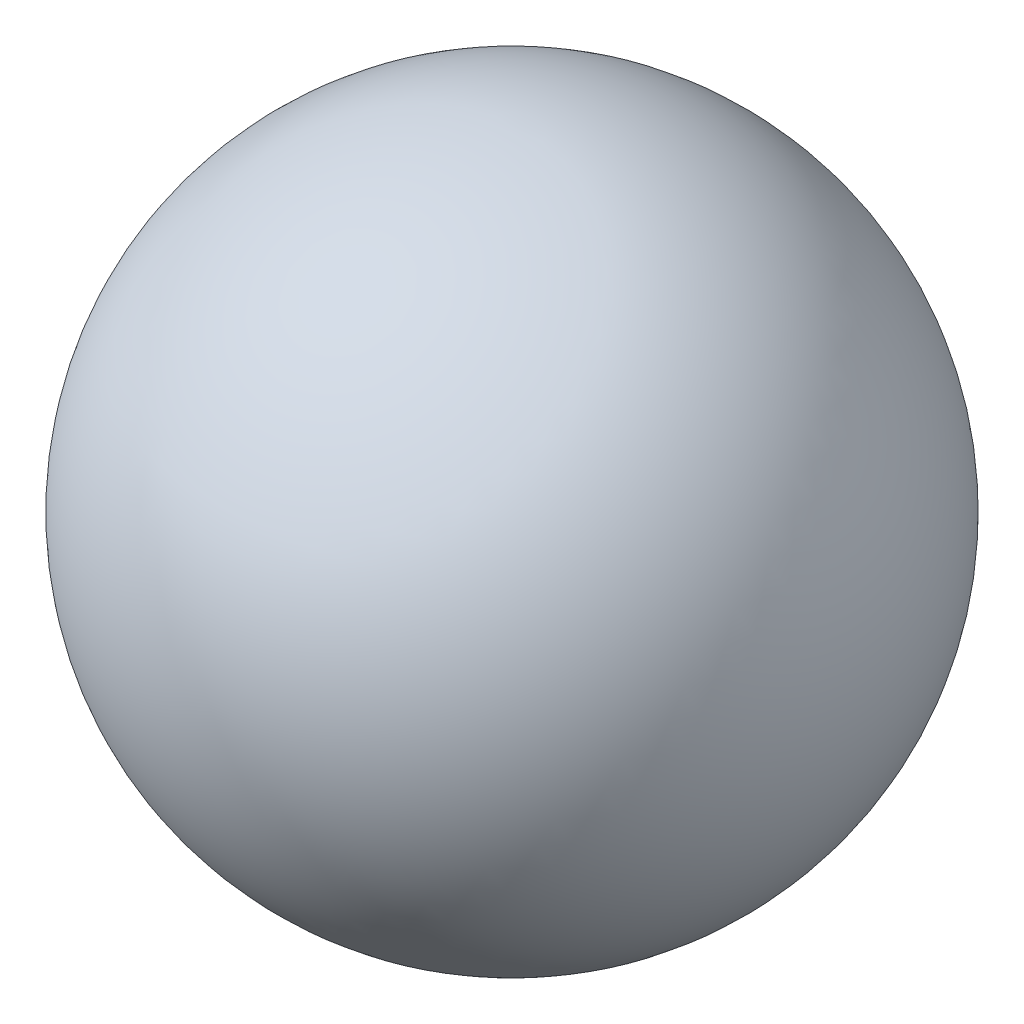
ISO-10303-21;
HEADER;
FILE_DESCRIPTION(('STEP AP214'),'2;1');
FILE_NAME('part.step','',(''),(''),'','','');
FILE_SCHEMA(('AUTOMOTIVE_DESIGN { 1 0 10303 214 1 1 1 1 }'));
ENDSEC;
DATA;
#1=APPLICATION_CONTEXT('core data for automotive mechanical design processes');
#2=APPLICATION_PROTOCOL_DEFINITION('international standard','automotive_design',2000,#1);
#3=PRODUCT_CONTEXT('',#1,'mechanical');
#4=PRODUCT('Part','Part','',(#3));
#5=PRODUCT_RELATED_PRODUCT_CATEGORY('part','',(#4));
#6=PRODUCT_DEFINITION_FORMATION('','',#4);
#7=PRODUCT_DEFINITION_CONTEXT('part definition',#1,'design');
#8=PRODUCT_DEFINITION('design','',#6,#7);
#9=PRODUCT_DEFINITION_SHAPE('','',#8);
#10=(LENGTH_UNIT() NAMED_UNIT(*) SI_UNIT(.MILLI.,.METRE.));
#11=(NAMED_UNIT(*) PLANE_ANGLE_UNIT() SI_UNIT($,.RADIAN.));
#12=(NAMED_UNIT(*) SI_UNIT($,.STERADIAN.) SOLID_ANGLE_UNIT());
#13=UNCERTAINTY_MEASURE_WITH_UNIT(LENGTH_MEASURE(1.E-05),#10,'distance_accuracy_value','');
#14=(GEOMETRIC_REPRESENTATION_CONTEXT(3) GLOBAL_UNCERTAINTY_ASSIGNED_CONTEXT((#13)) GLOBAL_UNIT_ASSIGNED_CONTEXT((#10,
#11,#12)) REPRESENTATION_CONTEXT('',''));
#15=CARTESIAN_POINT('',(0.,0.,0.));
#16=DIRECTION('',(0.,0.,1.));
#17=DIRECTION('',(1.,0.,0.));
#18=AXIS2_PLACEMENT_3D('',#15,#16,#17);
#19=CARTESIAN_POINT('',(0.,0.,0.));
#20=DIRECTION('',(0.,-1.,0.));
#21=DIRECTION('',(-1.,0.,0.));
#22=AXIS2_PLACEMENT_3D('',#19,#20,#21);
#23=SPHERICAL_SURFACE('',#22,12.7);
#24=CARTESIAN_POINT('',(0.,-12.7,0.));
#25=VERTEX_POINT('',#24);
#26=VERTEX_LOOP('',#25);
#27=FACE_BOUND('',#26,.T.);
#28=ADVANCED_FACE('F32',(#27),#23,.T.);
#29=CLOSED_SHELL('',(#28));
#30=CARTESIAN_POINT('',(0.,0.,0.));
#31=DIRECTION('',(0.,-1.,0.));
#32=DIRECTION('',(1.,0.,0.));
#33=AXIS2_PLACEMENT_3D('',#30,#31,#32);
#34=SPHERICAL_SURFACE('',#33,12.2174);
#35=CARTESIAN_POINT('',(0.,-12.2174,0.));
#36=VERTEX_POINT('',#35);
#37=VERTEX_LOOP('',#36);
#38=FACE_BOUND('',#37,.T.);
#39=ADVANCED_FACE('F45',(#38),#34,.F.);
#40=CLOSED_SHELL('',(#39));
#41=ORIENTED_CLOSED_SHELL('',*,#40,.T.);
#42=BREP_WITH_VOIDS('B2',#29,(#41));
#43=ADVANCED_BREP_SHAPE_REPRESENTATION('',(#18,#42),#14);
#44=SHAPE_DEFINITION_REPRESENTATION(#9,#43);
ENDSEC;
END-ISO-10303-21;
